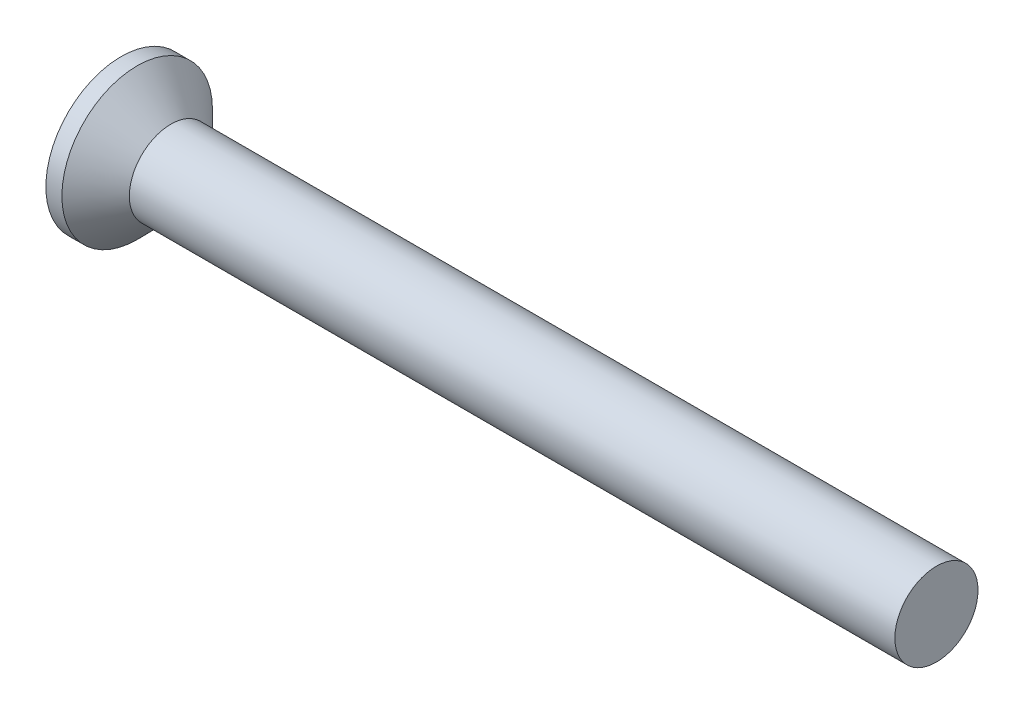
ISO-10303-21;
HEADER;
FILE_DESCRIPTION(('STEP AP214'),'2;1');
FILE_NAME('part.step','',(''),(''),'','','');
FILE_SCHEMA(('AUTOMOTIVE_DESIGN { 1 0 10303 214 1 1 1 1 }'));
ENDSEC;
DATA;
#1=APPLICATION_CONTEXT('core data for automotive mechanical design processes');
#2=APPLICATION_PROTOCOL_DEFINITION('international standard','automotive_design',2000,#1);
#3=PRODUCT_CONTEXT('',#1,'mechanical');
#4=PRODUCT('Part','Part','',(#3));
#5=PRODUCT_RELATED_PRODUCT_CATEGORY('part','',(#4));
#6=PRODUCT_DEFINITION_FORMATION('','',#4);
#7=PRODUCT_DEFINITION_CONTEXT('part definition',#1,'design');
#8=PRODUCT_DEFINITION('design','',#6,#7);
#9=PRODUCT_DEFINITION_SHAPE('','',#8);
#10=(LENGTH_UNIT() NAMED_UNIT(*) SI_UNIT(.MILLI.,.METRE.));
#11=(NAMED_UNIT(*) PLANE_ANGLE_UNIT() SI_UNIT($,.RADIAN.));
#12=(NAMED_UNIT(*) SI_UNIT($,.STERADIAN.) SOLID_ANGLE_UNIT());
#13=UNCERTAINTY_MEASURE_WITH_UNIT(LENGTH_MEASURE(1.E-05),#10,'distance_accuracy_value','');
#14=(GEOMETRIC_REPRESENTATION_CONTEXT(3) GLOBAL_UNCERTAINTY_ASSIGNED_CONTEXT((#13)) GLOBAL_UNIT_ASSIGNED_CONTEXT((#10,
#11,#12)) REPRESENTATION_CONTEXT('',''));
#15=CARTESIAN_POINT('',(0.,0.,0.));
#16=DIRECTION('',(0.,0.,1.));
#17=DIRECTION('',(1.,0.,0.));
#18=AXIS2_PLACEMENT_3D('',#15,#16,#17);
#19=CARTESIAN_POINT('',(10.0007106781187,0.,0.));
#20=DIRECTION('',(-1.,0.,0.));
#21=DIRECTION('',(0.,0.,1.));
#22=AXIS2_PLACEMENT_3D('',#19,#20,#21);
#23=CYLINDRICAL_SURFACE('',#22,1.52928932188135);
#24=CARTESIAN_POINT('',(1.83071067811866,0.,0.));
#25=DIRECTION('',(-1.,0.,0.));
#26=DIRECTION('',(0.,0.,1.));
#27=AXIS2_PLACEMENT_3D('',#24,#25,#26);
#28=CIRCLE('',#27,1.52928932188135);
#29=CARTESIAN_POINT('',(1.83071067811866,0.,1.52928932188135));
#30=VERTEX_POINT('',#29);
#31=EDGE_CURVE('E11',#30,#30,#28,.F.);
#32=ORIENTED_EDGE('',*,*,#31,.T.);
#33=EDGE_LOOP('',(#32));
#34=FACE_BOUND('',#33,.T.);
#35=CARTESIAN_POINT('',(30.0007106781187,0.,0.));
#36=DIRECTION('',(1.,0.,0.));
#37=DIRECTION('',(0.,0.,-1.));
#38=AXIS2_PLACEMENT_3D('',#35,#36,#37);
#39=CIRCLE('',#38,1.52928932188135);
#40=CARTESIAN_POINT('',(30.0007106781187,0.,-1.52928932188135));
#41=VERTEX_POINT('',#40);
#42=EDGE_CURVE('E45',#41,#41,#39,.F.);
#43=ORIENTED_EDGE('',*,*,#42,.T.);
#44=EDGE_LOOP('',(#43));
#45=FACE_BOUND('',#44,.T.);
#46=ADVANCED_FACE('F41',(#34,#45),#23,.T.);
#47=CARTESIAN_POINT('',(1.09999999999999,0.,0.));
#48=DIRECTION('',(-1.,0.,0.));
#49=DIRECTION('',(0.,0.,1.));
#50=AXIS2_PLACEMENT_3D('',#47,#48,#49);
#51=CONICAL_SURFACE('',#50,0.99999999999989,1.04719755119658);
#52=CARTESIAN_POINT('',(1.67735026918958,0.,0.));
#53=VERTEX_POINT('',#52);
#54=VERTEX_LOOP('',#53);
#55=FACE_BOUND('',#54,.T.);
#56=CARTESIAN_POINT('',(1.09999999999999,0.,0.));
#57=DIRECTION('',(-1.,0.,0.));
#58=DIRECTION('',(0.,0.,1.));
#59=AXIS2_PLACEMENT_3D('',#56,#57,#58);
#60=CIRCLE('',#59,0.99999999999989);
#61=CARTESIAN_POINT('',(1.09999999999999,-0.499999999999972,0.86602540378439));
#62=VERTEX_POINT('',#61);
#63=CARTESIAN_POINT('',(1.09999999999999,0.499999999999972,0.866025403784391));
#64=VERTEX_POINT('',#63);
#65=EDGE_CURVE('E118',#62,#64,#60,.T.);
#66=ORIENTED_EDGE('',*,*,#65,.T.);
#67=CARTESIAN_POINT('',(1.09999999999999,0.,0.));
#68=DIRECTION('',(-1.,0.,0.));
#69=DIRECTION('',(0.,0.,1.));
#70=AXIS2_PLACEMENT_3D('',#67,#68,#69);
#71=CIRCLE('',#70,0.99999999999989);
#72=CARTESIAN_POINT('',(1.09999999999999,0.999999999999945,0.));
#73=VERTEX_POINT('',#72);
#74=EDGE_CURVE('E132',#64,#73,#71,.T.);
#75=ORIENTED_EDGE('',*,*,#74,.T.);
#76=CARTESIAN_POINT('',(1.09999999999999,0.,0.));
#77=DIRECTION('',(-1.,0.,0.));
#78=DIRECTION('',(0.,0.,1.));
#79=AXIS2_PLACEMENT_3D('',#76,#77,#78);
#80=CIRCLE('',#79,0.99999999999989);
#81=CARTESIAN_POINT('',(1.09999999999999,0.499999999999972,-0.866025403784391));
#82=VERTEX_POINT('',#81);
#83=EDGE_CURVE('E172',#73,#82,#80,.T.);
#84=ORIENTED_EDGE('',*,*,#83,.T.);
#85=CARTESIAN_POINT('',(1.09999999999999,0.,0.));
#86=DIRECTION('',(-1.,0.,0.));
#87=DIRECTION('',(0.,0.,1.));
#88=AXIS2_PLACEMENT_3D('',#85,#86,#87);
#89=CIRCLE('',#88,0.99999999999989);
#90=CARTESIAN_POINT('',(1.09999999999999,-0.499999999999973,-0.866025403784392));
#91=VERTEX_POINT('',#90);
#92=EDGE_CURVE('E163',#82,#91,#89,.T.);
#93=ORIENTED_EDGE('',*,*,#92,.T.);
#94=CARTESIAN_POINT('',(1.09999999999999,0.,0.));
#95=DIRECTION('',(-1.,0.,0.));
#96=DIRECTION('',(0.,0.,1.));
#97=AXIS2_PLACEMENT_3D('',#94,#95,#96);
#98=CIRCLE('',#97,0.99999999999989);
#99=CARTESIAN_POINT('',(1.09999999999999,-0.999999999999945,0.));
#100=VERTEX_POINT('',#99);
#101=EDGE_CURVE('E114',#91,#100,#98,.T.);
#102=ORIENTED_EDGE('',*,*,#101,.T.);
#103=CARTESIAN_POINT('',(1.09999999999999,0.,0.));
#104=DIRECTION('',(-1.,0.,0.));
#105=DIRECTION('',(0.,0.,1.));
#106=AXIS2_PLACEMENT_3D('',#103,#104,#105);
#107=CIRCLE('',#106,0.99999999999989);
#108=EDGE_CURVE('E116',#100,#62,#107,.T.);
#109=ORIENTED_EDGE('',*,*,#108,.T.);
#110=EDGE_LOOP('',(#66,#75,#84,#93,#102,#109));
#111=FACE_BOUND('',#110,.T.);
#112=ADVANCED_FACE('F43',(#55,#111),#51,.F.);
#113=CARTESIAN_POINT('',(1.1,0.,-1.15470053837925));
#114=DIRECTION('',(1.,0.,0.));
#115=DIRECTION('',(0.,0.,-1.));
#116=AXIS2_PLACEMENT_3D('',#113,#114,#115);
#117=PLANE('',#116);
#118=DIRECTION('',(0.,0.,1.));
#119=VECTOR('',#118,1.);
#120=CARTESIAN_POINT('',(1.1,-1.,0.577350269189625));
#121=LINE('',#120,#119);
#122=CARTESIAN_POINT('',(1.1,-1.,0.577350269189624));
#123=VERTEX_POINT('',#122);
#124=EDGE_CURVE('E138',#123,#100,#121,.F.);
#125=ORIENTED_EDGE('',*,*,#124,.F.);
#126=DIRECTION('',(0.,0.866025403784439,0.5));
#127=VECTOR('',#126,1.);
#128=CARTESIAN_POINT('',(1.1,0.,1.15470053837925));
#129=LINE('',#128,#127);
#130=EDGE_CURVE('E135',#62,#123,#129,.F.);
#131=ORIENTED_EDGE('',*,*,#130,.F.);
#132=ORIENTED_EDGE('',*,*,#108,.F.);
#133=EDGE_LOOP('',(#125,#131,#132));
#134=FACE_BOUND('',#133,.T.);
#135=ADVANCED_FACE('F136',(#134),#117,.F.);
#136=CARTESIAN_POINT('',(1.1,0.,-1.15470053837925));
#137=DIRECTION('',(1.,0.,0.));
#138=DIRECTION('',(0.,0.,-1.));
#139=AXIS2_PLACEMENT_3D('',#136,#137,#138);
#140=PLANE('',#139);
#141=DIRECTION('',(0.,0.866025403784439,0.5));
#142=VECTOR('',#141,1.);
#143=CARTESIAN_POINT('',(1.1,0.,1.15470053837925));
#144=LINE('',#143,#142);
#145=CARTESIAN_POINT('',(1.1,0.,1.15470053837925));
#146=VERTEX_POINT('',#145);
#147=EDGE_CURVE('E127',#146,#62,#144,.F.);
#148=ORIENTED_EDGE('',*,*,#147,.F.);
#149=DIRECTION('',(0.,0.866025403784439,-0.5));
#150=VECTOR('',#149,1.);
#151=CARTESIAN_POINT('',(1.1,1.,0.577350269189625));
#152=LINE('',#151,#150);
#153=EDGE_CURVE('E130',#64,#146,#152,.F.);
#154=ORIENTED_EDGE('',*,*,#153,.F.);
#155=ORIENTED_EDGE('',*,*,#65,.F.);
#156=EDGE_LOOP('',(#148,#154,#155));
#157=FACE_BOUND('',#156,.T.);
#158=ADVANCED_FACE('F125',(#157),#140,.F.);
#159=CARTESIAN_POINT('',(1.1,0.,-1.15470053837925));
#160=DIRECTION('',(1.,0.,0.));
#161=DIRECTION('',(0.,0.,-1.));
#162=AXIS2_PLACEMENT_3D('',#159,#160,#161);
#163=PLANE('',#162);
#164=DIRECTION('',(0.,0.866025403784439,-0.5));
#165=VECTOR('',#164,1.);
#166=CARTESIAN_POINT('',(1.1,1.,0.577350269189625));
#167=LINE('',#166,#165);
#168=CARTESIAN_POINT('',(1.1,1.,0.577350269189625));
#169=VERTEX_POINT('',#168);
#170=EDGE_CURVE('E159',#169,#64,#167,.F.);
#171=ORIENTED_EDGE('',*,*,#170,.F.);
#172=DIRECTION('',(0.,0.,-1.));
#173=VECTOR('',#172,1.);
#174=CARTESIAN_POINT('',(1.1,1.,-0.577350269189625));
#175=LINE('',#174,#173);
#176=EDGE_CURVE('E188',#73,#169,#175,.F.);
#177=ORIENTED_EDGE('',*,*,#176,.F.);
#178=ORIENTED_EDGE('',*,*,#74,.F.);
#179=EDGE_LOOP('',(#171,#177,#178));
#180=FACE_BOUND('',#179,.T.);
#181=ADVANCED_FACE('F189',(#180),#163,.F.);
#182=CARTESIAN_POINT('',(1.1,0.,-1.15470053837925));
#183=DIRECTION('',(1.,0.,0.));
#184=DIRECTION('',(0.,0.,-1.));
#185=AXIS2_PLACEMENT_3D('',#182,#183,#184);
#186=PLANE('',#185);
#187=DIRECTION('',(0.,0.,-1.));
#188=VECTOR('',#187,1.);
#189=CARTESIAN_POINT('',(1.1,1.,-0.577350269189625));
#190=LINE('',#189,#188);
#191=CARTESIAN_POINT('',(1.1,1.,-0.577350269189625));
#192=VERTEX_POINT('',#191);
#193=EDGE_CURVE('E182',#192,#73,#190,.F.);
#194=ORIENTED_EDGE('',*,*,#193,.F.);
#195=DIRECTION('',(0.,-0.866025403784439,-0.5));
#196=VECTOR('',#195,1.);
#197=CARTESIAN_POINT('',(1.1,0.,-1.15470053837925));
#198=LINE('',#197,#196);
#199=EDGE_CURVE('E185',#82,#192,#198,.F.);
#200=ORIENTED_EDGE('',*,*,#199,.F.);
#201=ORIENTED_EDGE('',*,*,#83,.F.);
#202=EDGE_LOOP('',(#194,#200,#201));
#203=FACE_BOUND('',#202,.T.);
#204=ADVANCED_FACE('F180',(#203),#186,.F.);
#205=CARTESIAN_POINT('',(1.1,0.,-1.15470053837925));
#206=DIRECTION('',(1.,0.,0.));
#207=DIRECTION('',(0.,0.,-1.));
#208=AXIS2_PLACEMENT_3D('',#205,#206,#207);
#209=PLANE('',#208);
#210=DIRECTION('',(0.,-0.866025403784439,0.5));
#211=VECTOR('',#210,1.);
#212=CARTESIAN_POINT('',(1.1,-1.,-0.577350269189628));
#213=LINE('',#212,#211);
#214=CARTESIAN_POINT('',(1.1,-1.,-0.577350269189628));
#215=VERTEX_POINT('',#214);
#216=EDGE_CURVE('E234',#215,#91,#213,.F.);
#217=ORIENTED_EDGE('',*,*,#216,.F.);
#218=DIRECTION('',(0.,0.,1.));
#219=VECTOR('',#218,1.);
#220=CARTESIAN_POINT('',(1.1,-1.,0.577350269189625));
#221=LINE('',#220,#219);
#222=EDGE_CURVE('E147',#100,#215,#221,.F.);
#223=ORIENTED_EDGE('',*,*,#222,.F.);
#224=ORIENTED_EDGE('',*,*,#101,.F.);
#225=EDGE_LOOP('',(#217,#223,#224));
#226=FACE_BOUND('',#225,.T.);
#227=ADVANCED_FACE('F273',(#226),#209,.F.);
#228=CARTESIAN_POINT('',(1.1,0.,-1.15470053837925));
#229=DIRECTION('',(1.,0.,0.));
#230=DIRECTION('',(0.,0.,-1.));
#231=AXIS2_PLACEMENT_3D('',#228,#229,#230);
#232=PLANE('',#231);
#233=DIRECTION('',(0.,-0.866025403784439,-0.5));
#234=VECTOR('',#233,1.);
#235=CARTESIAN_POINT('',(1.1,0.,-1.15470053837925));
#236=LINE('',#235,#234);
#237=CARTESIAN_POINT('',(1.1,0.,-1.15470053837925));
#238=VERTEX_POINT('',#237);
#239=EDGE_CURVE('E207',#238,#82,#236,.F.);
#240=ORIENTED_EDGE('',*,*,#239,.F.);
#241=DIRECTION('',(0.,-0.866025403784439,0.5));
#242=VECTOR('',#241,1.);
#243=CARTESIAN_POINT('',(1.1,-1.,-0.577350269189628));
#244=LINE('',#243,#242);
#245=EDGE_CURVE('E237',#91,#238,#244,.F.);
#246=ORIENTED_EDGE('',*,*,#245,.F.);
#247=ORIENTED_EDGE('',*,*,#92,.F.);
#248=EDGE_LOOP('',(#240,#246,#247));
#249=FACE_BOUND('',#248,.T.);
#250=ADVANCED_FACE('F270',(#249),#232,.F.);
#251=CARTESIAN_POINT('',(1.1,-1.,0.577350269189625));
#252=DIRECTION('',(0.,1.,0.));
#253=DIRECTION('',(0.,0.,1.));
#254=AXIS2_PLACEMENT_3D('',#251,#252,#253);
#255=PLANE('',#254);
#256=ORIENTED_EDGE('',*,*,#222,.T.);
#257=DIRECTION('',(1.,0.,0.));
#258=VECTOR('',#257,1.);
#259=CARTESIAN_POINT('',(1.1,-1.,-0.577350269189628));
#260=LINE('',#259,#258);
#261=CARTESIAN_POINT('',(0.,-1.,-0.577350269189628));
#262=VERTEX_POINT('',#261);
#263=EDGE_CURVE('E238',#262,#215,#260,.T.);
#264=ORIENTED_EDGE('',*,*,#263,.F.);
#265=DIRECTION('',(0.,0.,-1.));
#266=VECTOR('',#265,1.);
#267=CARTESIAN_POINT('',(0.,-1.,0.));
#268=LINE('',#267,#266);
#269=CARTESIAN_POINT('',(0.,-1.,0.577350269189625));
#270=VERTEX_POINT('',#269);
#271=EDGE_CURVE('E233',#262,#270,#268,.F.);
#272=ORIENTED_EDGE('',*,*,#271,.T.);
#273=DIRECTION('',(1.,0.,0.));
#274=VECTOR('',#273,1.);
#275=CARTESIAN_POINT('',(1.1,-1.,0.577350269189624));
#276=LINE('',#275,#274);
#277=EDGE_CURVE('E142',#123,#270,#276,.F.);
#278=ORIENTED_EDGE('',*,*,#277,.F.);
#279=ORIENTED_EDGE('',*,*,#124,.T.);
#280=EDGE_LOOP('',(#256,#264,#272,#278,#279));
#281=FACE_BOUND('',#280,.T.);
#282=ADVANCED_FACE('F275',(#281),#255,.T.);
#283=CARTESIAN_POINT('',(1.1,0.,1.15470053837925));
#284=DIRECTION('',(0.,0.5,-0.866025403784439));
#285=DIRECTION('',(0.,0.866025403784439,0.5));
#286=AXIS2_PLACEMENT_3D('',#283,#284,#285);
#287=PLANE('',#286);
#288=ORIENTED_EDGE('',*,*,#130,.T.);
#289=ORIENTED_EDGE('',*,*,#277,.T.);
#290=DIRECTION('',(0.,0.866025403784439,0.499999999999999));
#291=VECTOR('',#290,1.);
#292=CARTESIAN_POINT('',(0.,-1.,0.577350269189625));
#293=LINE('',#292,#291);
#294=CARTESIAN_POINT('',(0.,0.,1.15470053837925));
#295=VERTEX_POINT('',#294);
#296=EDGE_CURVE('E228',#270,#295,#293,.T.);
#297=ORIENTED_EDGE('',*,*,#296,.T.);
#298=DIRECTION('',(1.,0.,0.));
#299=VECTOR('',#298,1.);
#300=CARTESIAN_POINT('',(1.1,0.,1.15470053837925));
#301=LINE('',#300,#299);
#302=EDGE_CURVE('E146',#146,#295,#301,.F.);
#303=ORIENTED_EDGE('',*,*,#302,.F.);
#304=ORIENTED_EDGE('',*,*,#147,.T.);
#305=EDGE_LOOP('',(#288,#289,#297,#303,#304));
#306=FACE_BOUND('',#305,.T.);
#307=ADVANCED_FACE('F144',(#306),#287,.T.);
#308=CARTESIAN_POINT('',(1.1,1.,0.577350269189625));
#309=DIRECTION('',(0.,-0.5,-0.866025403784439));
#310=DIRECTION('',(0.,0.866025403784439,-0.5));
#311=AXIS2_PLACEMENT_3D('',#308,#309,#310);
#312=PLANE('',#311);
#313=ORIENTED_EDGE('',*,*,#153,.T.);
#314=ORIENTED_EDGE('',*,*,#302,.T.);
#315=DIRECTION('',(0.,0.866025403784439,-0.5));
#316=VECTOR('',#315,1.);
#317=CARTESIAN_POINT('',(0.,0.,1.15470053837925));
#318=LINE('',#317,#316);
#319=CARTESIAN_POINT('',(0.,1.,0.577350269189625));
#320=VERTEX_POINT('',#319);
#321=EDGE_CURVE('E218',#295,#320,#318,.T.);
#322=ORIENTED_EDGE('',*,*,#321,.T.);
#323=DIRECTION('',(1.,0.,0.));
#324=VECTOR('',#323,1.);
#325=CARTESIAN_POINT('',(1.1,1.,0.577350269189625));
#326=LINE('',#325,#324);
#327=EDGE_CURVE('E193',#169,#320,#326,.F.);
#328=ORIENTED_EDGE('',*,*,#327,.F.);
#329=ORIENTED_EDGE('',*,*,#170,.T.);
#330=EDGE_LOOP('',(#313,#314,#322,#328,#329));
#331=FACE_BOUND('',#330,.T.);
#332=ADVANCED_FACE('F216',(#331),#312,.T.);
#333=CARTESIAN_POINT('',(1.1,1.,-0.577350269189625));
#334=DIRECTION('',(0.,-1.,0.));
#335=DIRECTION('',(0.,0.,-1.));
#336=AXIS2_PLACEMENT_3D('',#333,#334,#335);
#337=PLANE('',#336);
#338=ORIENTED_EDGE('',*,*,#176,.T.);
#339=ORIENTED_EDGE('',*,*,#327,.T.);
#340=DIRECTION('',(0.,0.,-1.));
#341=VECTOR('',#340,1.);
#342=CARTESIAN_POINT('',(0.,1.,0.));
#343=LINE('',#342,#341);
#344=CARTESIAN_POINT('',(0.,1.,-0.577350269189625));
#345=VERTEX_POINT('',#344);
#346=EDGE_CURVE('E220',#320,#345,#343,.T.);
#347=ORIENTED_EDGE('',*,*,#346,.T.);
#348=DIRECTION('',(1.,0.,0.));
#349=VECTOR('',#348,1.);
#350=CARTESIAN_POINT('',(1.1,1.,-0.577350269189626));
#351=LINE('',#350,#349);
#352=EDGE_CURVE('E196',#192,#345,#351,.F.);
#353=ORIENTED_EDGE('',*,*,#352,.F.);
#354=ORIENTED_EDGE('',*,*,#193,.T.);
#355=EDGE_LOOP('',(#338,#339,#347,#353,#354));
#356=FACE_BOUND('',#355,.T.);
#357=ADVANCED_FACE('F195',(#356),#337,.T.);
#358=CARTESIAN_POINT('',(1.1,0.,-1.15470053837925));
#359=DIRECTION('',(0.,-0.5,0.866025403784439));
#360=DIRECTION('',(0.,-0.866025403784439,-0.5));
#361=AXIS2_PLACEMENT_3D('',#358,#359,#360);
#362=PLANE('',#361);
#363=ORIENTED_EDGE('',*,*,#199,.T.);
#364=ORIENTED_EDGE('',*,*,#352,.T.);
#365=DIRECTION('',(0.,-0.866025403784438,-0.5));
#366=VECTOR('',#365,1.);
#367=CARTESIAN_POINT('',(0.,1.,-0.577350269189625));
#368=LINE('',#367,#366);
#369=CARTESIAN_POINT('',(0.,0.,-1.15470053837925));
#370=VERTEX_POINT('',#369);
#371=EDGE_CURVE('E60',#345,#370,#368,.T.);
#372=ORIENTED_EDGE('',*,*,#371,.T.);
#373=DIRECTION('',(1.,0.,0.));
#374=VECTOR('',#373,1.);
#375=CARTESIAN_POINT('',(1.1,0.,-1.15470053837925));
#376=LINE('',#375,#374);
#377=EDGE_CURVE('E243',#238,#370,#376,.F.);
#378=ORIENTED_EDGE('',*,*,#377,.F.);
#379=ORIENTED_EDGE('',*,*,#239,.T.);
#380=EDGE_LOOP('',(#363,#364,#372,#378,#379));
#381=FACE_BOUND('',#380,.T.);
#382=ADVANCED_FACE('F267',(#381),#362,.T.);
#383=CARTESIAN_POINT('',(1.1,-1.,-0.577350269189628));
#384=DIRECTION('',(0.,0.5,0.866025403784439));
#385=DIRECTION('',(0.,-0.866025403784439,0.5));
#386=AXIS2_PLACEMENT_3D('',#383,#384,#385);
#387=PLANE('',#386);
#388=ORIENTED_EDGE('',*,*,#245,.T.);
#389=ORIENTED_EDGE('',*,*,#377,.T.);
#390=DIRECTION('',(0.,-0.866025403784439,0.5));
#391=VECTOR('',#390,1.);
#392=CARTESIAN_POINT('',(0.,0.,-1.15470053837925));
#393=LINE('',#392,#391);
#394=EDGE_CURVE('E169',#370,#262,#393,.T.);
#395=ORIENTED_EDGE('',*,*,#394,.T.);
#396=ORIENTED_EDGE('',*,*,#263,.T.);
#397=ORIENTED_EDGE('',*,*,#216,.T.);
#398=EDGE_LOOP('',(#388,#389,#395,#396,#397));
#399=FACE_BOUND('',#398,.T.);
#400=ADVANCED_FACE('F278',(#399),#387,.T.);
#401=CARTESIAN_POINT('',(0.,0.,0.));
#402=DIRECTION('',(1.,0.,0.));
#403=DIRECTION('',(0.,0.,-1.));
#404=AXIS2_PLACEMENT_3D('',#401,#402,#403);
#405=PLANE('',#404);
#406=ORIENTED_EDGE('',*,*,#371,.F.);
#407=ORIENTED_EDGE('',*,*,#346,.F.);
#408=ORIENTED_EDGE('',*,*,#321,.F.);
#409=ORIENTED_EDGE('',*,*,#296,.F.);
#410=ORIENTED_EDGE('',*,*,#271,.F.);
#411=ORIENTED_EDGE('',*,*,#394,.F.);
#412=EDGE_LOOP('',(#406,#407,#408,#409,#410,#411));
#413=FACE_BOUND('',#412,.T.);
#414=CARTESIAN_POINT('',(0.,0.,0.));
#415=DIRECTION('',(1.,0.,0.));
#416=DIRECTION('',(0.,0.,-1.));
#417=AXIS2_PLACEMENT_3D('',#414,#415,#416);
#418=CIRCLE('',#417,2.77);
#419=CARTESIAN_POINT('',(0.,0.,-2.77));
#420=VERTEX_POINT('',#419);
#421=EDGE_CURVE('E166',#420,#420,#418,.T.);
#422=ORIENTED_EDGE('',*,*,#421,.F.);
#423=EDGE_LOOP('',(#422));
#424=FACE_BOUND('',#423,.T.);
#425=ADVANCED_FACE('F222',(#413,#424),#405,.F.);
#426=CARTESIAN_POINT('',(11.8531386861314,0.,0.));
#427=DIRECTION('',(1.,0.,0.));
#428=DIRECTION('',(0.,0.,-1.));
#429=AXIS2_PLACEMENT_3D('',#426,#427,#428);
#430=CYLINDRICAL_SURFACE('',#429,2.77);
#431=CARTESIAN_POINT('',(0.589999999988322,0.,0.));
#432=DIRECTION('',(-1.,0.,0.));
#433=DIRECTION('',(0.,0.,-1.));
#434=AXIS2_PLACEMENT_3D('',#431,#432,#433);
#435=CIRCLE('',#434,2.77000000005501);
#436=CARTESIAN_POINT('',(0.589999999988322,0.,-2.77000000005501));
#437=VERTEX_POINT('',#436);
#438=EDGE_CURVE('E51',#437,#437,#435,.F.);
#439=ORIENTED_EDGE('',*,*,#438,.F.);
#440=EDGE_LOOP('',(#439));
#441=FACE_BOUND('',#440,.T.);
#442=ORIENTED_EDGE('',*,*,#421,.T.);
#443=EDGE_LOOP('',(#442));
#444=FACE_BOUND('',#443,.T.);
#445=ADVANCED_FACE('F285',(#441,#444),#430,.T.);
#446=CARTESIAN_POINT('',(0.589999999931479,0.,0.));
#447=DIRECTION('',(-1.,0.,0.));
#448=DIRECTION('',(0.,0.,1.));
#449=AXIS2_PLACEMENT_3D('',#446,#447,#448);
#450=CONICAL_SURFACE('',#449,2.77000000011185,0.785398163397448);
#451=ORIENTED_EDGE('',*,*,#438,.T.);
#452=EDGE_LOOP('',(#451));
#453=FACE_BOUND('',#452,.T.);
#454=ORIENTED_EDGE('',*,*,#31,.F.);
#455=EDGE_LOOP('',(#454));
#456=FACE_BOUND('',#455,.T.);
#457=ADVANCED_FACE('F292',(#453,#456),#450,.T.);
#458=CARTESIAN_POINT('',(30.0007106781187,0.,0.));
#459=DIRECTION('',(1.,0.,0.));
#460=DIRECTION('',(0.,0.,-1.));
#461=AXIS2_PLACEMENT_3D('',#458,#459,#460);
#462=PLANE('',#461);
#463=ORIENTED_EDGE('',*,*,#42,.F.);
#464=EDGE_LOOP('',(#463));
#465=FACE_BOUND('',#464,.T.);
#466=ADVANCED_FACE('F299',(#465),#462,.T.);
#467=CLOSED_SHELL('',(#46,#112,#135,#158,#181,#204,#227,#250,#282,#307,#332,#357,#382,#400,#425,
#445,#457,#466));
#468=MANIFOLD_SOLID_BREP('B2',#467);
#469=ADVANCED_BREP_SHAPE_REPRESENTATION('',(#18,#468),#14);
#470=SHAPE_DEFINITION_REPRESENTATION(#9,#469);
ENDSEC;
END-ISO-10303-21;
